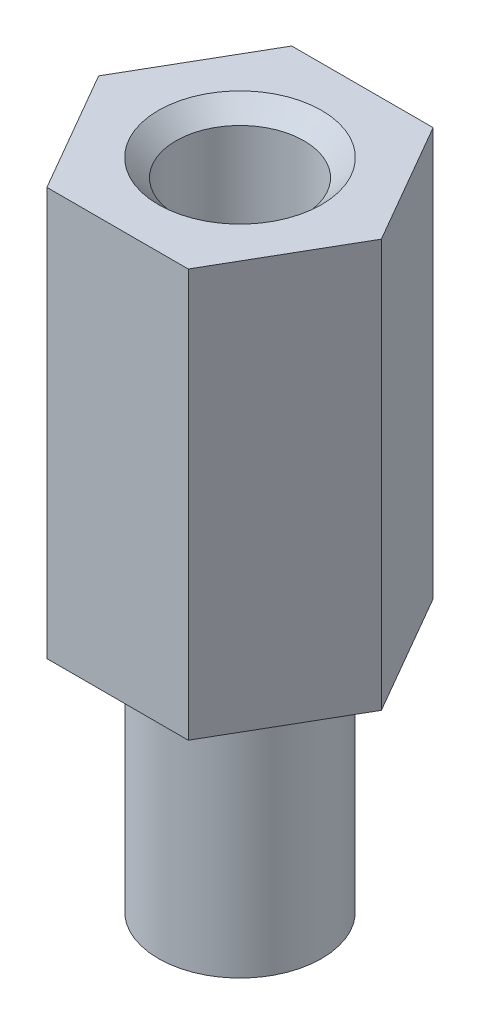
ISO-10303-21;
HEADER;
FILE_DESCRIPTION(('STEP AP214'),'2;1');
FILE_NAME('part.step','',(''),(''),'','','');
FILE_SCHEMA(('AUTOMOTIVE_DESIGN { 1 0 10303 214 1 1 1 1 }'));
ENDSEC;
DATA;
#1=APPLICATION_CONTEXT('core data for automotive mechanical design processes');
#2=APPLICATION_PROTOCOL_DEFINITION('international standard','automotive_design',2000,#1);
#3=PRODUCT_CONTEXT('',#1,'mechanical');
#4=PRODUCT('Part','Part','',(#3));
#5=PRODUCT_RELATED_PRODUCT_CATEGORY('part','',(#4));
#6=PRODUCT_DEFINITION_FORMATION('','',#4);
#7=PRODUCT_DEFINITION_CONTEXT('part definition',#1,'design');
#8=PRODUCT_DEFINITION('design','',#6,#7);
#9=PRODUCT_DEFINITION_SHAPE('','',#8);
#10=(LENGTH_UNIT() NAMED_UNIT(*) SI_UNIT(.MILLI.,.METRE.));
#11=(NAMED_UNIT(*) PLANE_ANGLE_UNIT() SI_UNIT($,.RADIAN.));
#12=(NAMED_UNIT(*) SI_UNIT($,.STERADIAN.) SOLID_ANGLE_UNIT());
#13=UNCERTAINTY_MEASURE_WITH_UNIT(LENGTH_MEASURE(1.E-05),#10,'distance_accuracy_value','');
#14=(GEOMETRIC_REPRESENTATION_CONTEXT(3) GLOBAL_UNCERTAINTY_ASSIGNED_CONTEXT((#13)) GLOBAL_UNIT_ASSIGNED_CONTEXT((#10,
#11,#12)) REPRESENTATION_CONTEXT('',''));
#15=CARTESIAN_POINT('',(0.,0.,0.));
#16=DIRECTION('',(0.,0.,1.));
#17=DIRECTION('',(1.,0.,0.));
#18=AXIS2_PLACEMENT_3D('',#15,#16,#17);
#19=CARTESIAN_POINT('',(0.,0.,0.));
#20=DIRECTION('',(0.,-1.,0.));
#21=DIRECTION('',(0.,0.,-1.));
#22=AXIS2_PLACEMENT_3D('',#19,#20,#21);
#23=PLANE('',#22);
#24=CARTESIAN_POINT('',(0.,0.,0.));
#25=DIRECTION('',(0.,-1.,0.));
#26=DIRECTION('',(0.,0.,-1.));
#27=AXIS2_PLACEMENT_3D('',#24,#25,#26);
#28=CIRCLE('',#27,0.785);
#29=CARTESIAN_POINT('',(0.,0.,-0.785));
#30=VERTEX_POINT('',#29);
#31=EDGE_CURVE('E20',#30,#30,#28,.F.);
#32=ORIENTED_EDGE('',*,*,#31,.T.);
#33=EDGE_LOOP('',(#32));
#34=FACE_BOUND('',#33,.T.);
#35=ADVANCED_FACE('F17',(#34),#23,.F.);
#36=CARTESIAN_POINT('',(0.,4.,0.));
#37=DIRECTION('',(0.,-1.,0.));
#38=DIRECTION('',(0.,0.,-1.));
#39=AXIS2_PLACEMENT_3D('',#36,#37,#38);
#40=CYLINDRICAL_SURFACE('',#39,0.785);
#41=CARTESIAN_POINT('',(0.,3.78499999993664,0.));
#42=DIRECTION('',(0.,1.,0.));
#43=DIRECTION('',(0.,0.,1.));
#44=AXIS2_PLACEMENT_3D('',#41,#42,#43);
#45=CIRCLE('',#44,0.785000000007585);
#46=CARTESIAN_POINT('',(0.,3.78499999993664,0.785000000007585));
#47=VERTEX_POINT('',#46);
#48=EDGE_CURVE('E77',#47,#47,#45,.T.);
#49=ORIENTED_EDGE('',*,*,#48,.T.);
#50=EDGE_LOOP('',(#49));
#51=FACE_BOUND('',#50,.T.);
#52=ORIENTED_EDGE('',*,*,#31,.F.);
#53=EDGE_LOOP('',(#52));
#54=FACE_BOUND('',#53,.T.);
#55=ADVANCED_FACE('F243',(#51,#54),#40,.F.);
#56=CARTESIAN_POINT('',(-0.866025403784439,4.,1.5));
#57=DIRECTION('',(0.,0.,-1.));
#58=DIRECTION('',(-1.,0.,0.));
#59=AXIS2_PLACEMENT_3D('',#56,#57,#58);
#60=PLANE('',#59);
#61=DIRECTION('',(-1.,0.,0.));
#62=VECTOR('',#61,1.);
#63=CARTESIAN_POINT('',(-0.866025403784439,-1.,1.5));
#64=LINE('',#63,#62);
#65=CARTESIAN_POINT('',(0.866025403784439,-1.,1.5));
#66=VERTEX_POINT('',#65);
#67=CARTESIAN_POINT('',(-0.866025403784439,-1.,1.5));
#68=VERTEX_POINT('',#67);
#69=EDGE_CURVE('E68',#66,#68,#64,.T.);
#70=ORIENTED_EDGE('',*,*,#69,.F.);
#71=DIRECTION('',(0.,1.,0.));
#72=VECTOR('',#71,1.);
#73=CARTESIAN_POINT('',(0.866025403784439,4.,1.5));
#74=LINE('',#73,#72);
#75=CARTESIAN_POINT('',(0.866025403784439,4.,1.5));
#76=VERTEX_POINT('',#75);
#77=EDGE_CURVE('E90',#66,#76,#74,.T.);
#78=ORIENTED_EDGE('',*,*,#77,.T.);
#79=DIRECTION('',(-1.,0.,0.));
#80=VECTOR('',#79,1.);
#81=CARTESIAN_POINT('',(-0.866025403784439,4.,1.5));
#82=LINE('',#81,#80);
#83=CARTESIAN_POINT('',(-0.866025403784439,4.,1.5));
#84=VERTEX_POINT('',#83);
#85=EDGE_CURVE('E78',#84,#76,#82,.F.);
#86=ORIENTED_EDGE('',*,*,#85,.F.);
#87=DIRECTION('',(0.,1.,0.));
#88=VECTOR('',#87,1.);
#89=CARTESIAN_POINT('',(-0.866025403784439,4.,1.5));
#90=LINE('',#89,#88);
#91=EDGE_CURVE('E81',#84,#68,#90,.F.);
#92=ORIENTED_EDGE('',*,*,#91,.T.);
#93=EDGE_LOOP('',(#70,#78,#86,#92));
#94=FACE_BOUND('',#93,.T.);
#95=ADVANCED_FACE('F82',(#94),#60,.F.);
#96=CARTESIAN_POINT('',(0.,3.99999999984857,0.));
#97=DIRECTION('',(0.,1.,0.));
#98=DIRECTION('',(0.,0.,1.));
#99=AXIS2_PLACEMENT_3D('',#96,#97,#98);
#100=CONICAL_SURFACE('',#99,0.99999999991951,0.785398163397448);
#101=ORIENTED_EDGE('',*,*,#48,.F.);
#102=EDGE_LOOP('',(#101));
#103=FACE_BOUND('',#102,.T.);
#104=CARTESIAN_POINT('',(0.,3.99999999990541,0.));
#105=DIRECTION('',(0.,1.,0.));
#106=DIRECTION('',(0.,0.,1.));
#107=AXIS2_PLACEMENT_3D('',#104,#105,#106);
#108=CIRCLE('',#107,0.999999999976353);
#109=CARTESIAN_POINT('',(0.,3.99999999990541,0.999999999976353));
#110=VERTEX_POINT('',#109);
#111=EDGE_CURVE('E99',#110,#110,#108,.F.);
#112=ORIENTED_EDGE('',*,*,#111,.F.);
#113=EDGE_LOOP('',(#112));
#114=FACE_BOUND('',#113,.T.);
#115=ADVANCED_FACE('F227',(#103,#114),#100,.F.);
#116=CARTESIAN_POINT('',(-1.73205080756888,4.,0.));
#117=DIRECTION('',(0.866025403784439,0.,-0.5));
#118=DIRECTION('',(-0.5,0.,-0.866025403784439));
#119=AXIS2_PLACEMENT_3D('',#116,#117,#118);
#120=PLANE('',#119);
#121=DIRECTION('',(-0.5,0.,-0.866025403784439));
#122=VECTOR('',#121,1.);
#123=CARTESIAN_POINT('',(-1.73205080756888,-1.,0.));
#124=LINE('',#123,#122);
#125=CARTESIAN_POINT('',(-1.73205080756888,-1.,0.));
#126=VERTEX_POINT('',#125);
#127=EDGE_CURVE('E72',#68,#126,#124,.T.);
#128=ORIENTED_EDGE('',*,*,#127,.F.);
#129=ORIENTED_EDGE('',*,*,#91,.F.);
#130=DIRECTION('',(0.5,0.,0.866025403784439));
#131=VECTOR('',#130,1.);
#132=CARTESIAN_POINT('',(-1.73205080756888,4.,0.));
#133=LINE('',#132,#131);
#134=CARTESIAN_POINT('',(-1.73205080756888,4.,0.));
#135=VERTEX_POINT('',#134);
#136=EDGE_CURVE('E104',#135,#84,#133,.T.);
#137=ORIENTED_EDGE('',*,*,#136,.F.);
#138=DIRECTION('',(0.,1.,0.));
#139=VECTOR('',#138,1.);
#140=CARTESIAN_POINT('',(-1.73205080756888,4.,0.));
#141=LINE('',#140,#139);
#142=EDGE_CURVE('E88',#135,#126,#141,.F.);
#143=ORIENTED_EDGE('',*,*,#142,.T.);
#144=EDGE_LOOP('',(#128,#129,#137,#143));
#145=FACE_BOUND('',#144,.T.);
#146=ADVANCED_FACE('F86',(#145),#120,.F.);
#147=CARTESIAN_POINT('',(0.866025403784439,4.,1.5));
#148=DIRECTION('',(-0.866025403784432,0.,-0.500000000000011));
#149=DIRECTION('',(-0.500000000000011,0.,0.866025403784432));
#150=AXIS2_PLACEMENT_3D('',#147,#148,#149);
#151=PLANE('',#150);
#152=DIRECTION('',(-0.500000000000011,0.,0.866025403784432));
#153=VECTOR('',#152,1.);
#154=CARTESIAN_POINT('',(0.866025403784439,-1.,1.5));
#155=LINE('',#154,#153);
#156=CARTESIAN_POINT('',(1.7320508075689,-1.,0.));
#157=VERTEX_POINT('',#156);
#158=EDGE_CURVE('E66',#157,#66,#155,.T.);
#159=ORIENTED_EDGE('',*,*,#158,.F.);
#160=DIRECTION('',(0.,1.,0.));
#161=VECTOR('',#160,1.);
#162=CARTESIAN_POINT('',(1.7320508075689,4.,0.));
#163=LINE('',#162,#161);
#164=CARTESIAN_POINT('',(1.7320508075689,4.,0.));
#165=VERTEX_POINT('',#164);
#166=EDGE_CURVE('E118',#157,#165,#163,.T.);
#167=ORIENTED_EDGE('',*,*,#166,.T.);
#168=DIRECTION('',(0.500000000000011,0.,-0.866025403784432));
#169=VECTOR('',#168,1.);
#170=CARTESIAN_POINT('',(0.866025403784439,4.,1.5));
#171=LINE('',#170,#169);
#172=EDGE_CURVE('E101',#76,#165,#171,.T.);
#173=ORIENTED_EDGE('',*,*,#172,.F.);
#174=ORIENTED_EDGE('',*,*,#77,.F.);
#175=EDGE_LOOP('',(#159,#167,#173,#174));
#176=FACE_BOUND('',#175,.T.);
#177=ADVANCED_FACE('F139',(#176),#151,.F.);
#178=CARTESIAN_POINT('',(0.,4.,0.));
#179=DIRECTION('',(0.,1.,0.));
#180=DIRECTION('',(0.,0.,1.));
#181=AXIS2_PLACEMENT_3D('',#178,#179,#180);
#182=PLANE('',#181);
#183=ORIENTED_EDGE('',*,*,#136,.T.);
#184=ORIENTED_EDGE('',*,*,#85,.T.);
#185=ORIENTED_EDGE('',*,*,#172,.T.);
#186=DIRECTION('',(0.500000000000008,0.,0.866025403784434));
#187=VECTOR('',#186,1.);
#188=CARTESIAN_POINT('',(1.7320508075689,4.,0.));
#189=LINE('',#188,#187);
#190=CARTESIAN_POINT('',(0.866025403784438,4.,-1.5));
#191=VERTEX_POINT('',#190);
#192=EDGE_CURVE('E114',#165,#191,#189,.F.);
#193=ORIENTED_EDGE('',*,*,#192,.T.);
#194=DIRECTION('',(1.,0.,0.));
#195=VECTOR('',#194,1.);
#196=CARTESIAN_POINT('',(0.866025403784438,4.,-1.5));
#197=LINE('',#196,#195);
#198=CARTESIAN_POINT('',(-0.866025403784438,4.,-1.5));
#199=VERTEX_POINT('',#198);
#200=EDGE_CURVE('E121',#191,#199,#197,.F.);
#201=ORIENTED_EDGE('',*,*,#200,.T.);
#202=DIRECTION('',(0.5,0.,-0.866025403784439));
#203=VECTOR('',#202,1.);
#204=CARTESIAN_POINT('',(-0.866025403784439,4.,-1.5));
#205=LINE('',#204,#203);
#206=EDGE_CURVE('E109',#199,#135,#205,.F.);
#207=ORIENTED_EDGE('',*,*,#206,.T.);
#208=EDGE_LOOP('',(#183,#184,#185,#193,#201,#207));
#209=FACE_BOUND('',#208,.T.);
#210=ORIENTED_EDGE('',*,*,#111,.T.);
#211=EDGE_LOOP('',(#210));
#212=FACE_BOUND('',#211,.T.);
#213=ADVANCED_FACE('F141',(#209,#212),#182,.T.);
#214=CARTESIAN_POINT('',(-0.866025403784439,4.,-1.5));
#215=DIRECTION('',(0.866025403784439,0.,0.5));
#216=DIRECTION('',(0.5,0.,-0.866025403784439));
#217=AXIS2_PLACEMENT_3D('',#214,#215,#216);
#218=PLANE('',#217);
#219=DIRECTION('',(0.5,0.,-0.866025403784439));
#220=VECTOR('',#219,1.);
#221=CARTESIAN_POINT('',(-0.866025403784439,-1.,-1.5));
#222=LINE('',#221,#220);
#223=CARTESIAN_POINT('',(-0.866025403784439,-1.,-1.5));
#224=VERTEX_POINT('',#223);
#225=EDGE_CURVE('E35',#126,#224,#222,.T.);
#226=ORIENTED_EDGE('',*,*,#225,.F.);
#227=ORIENTED_EDGE('',*,*,#142,.F.);
#228=ORIENTED_EDGE('',*,*,#206,.F.);
#229=DIRECTION('',(0.,1.,0.));
#230=VECTOR('',#229,1.);
#231=CARTESIAN_POINT('',(-0.866025403784439,4.,-1.5));
#232=LINE('',#231,#230);
#233=EDGE_CURVE('E123',#199,#224,#232,.F.);
#234=ORIENTED_EDGE('',*,*,#233,.T.);
#235=EDGE_LOOP('',(#226,#227,#228,#234));
#236=FACE_BOUND('',#235,.T.);
#237=ADVANCED_FACE('F144',(#236),#218,.F.);
#238=CARTESIAN_POINT('',(1.7320508075689,4.,0.));
#239=DIRECTION('',(-0.866025403784434,0.,0.500000000000008));
#240=DIRECTION('',(0.500000000000008,0.,0.866025403784434));
#241=AXIS2_PLACEMENT_3D('',#238,#239,#240);
#242=PLANE('',#241);
#243=DIRECTION('',(0.500000000000008,0.,0.866025403784434));
#244=VECTOR('',#243,1.);
#245=CARTESIAN_POINT('',(1.7320508075689,-1.,0.));
#246=LINE('',#245,#244);
#247=CARTESIAN_POINT('',(0.866025403784438,-1.,-1.5));
#248=VERTEX_POINT('',#247);
#249=EDGE_CURVE('E116',#248,#157,#246,.T.);
#250=ORIENTED_EDGE('',*,*,#249,.F.);
#251=DIRECTION('',(0.,1.,0.));
#252=VECTOR('',#251,1.);
#253=CARTESIAN_POINT('',(0.866025403784438,4.,-1.5));
#254=LINE('',#253,#252);
#255=EDGE_CURVE('E125',#248,#191,#254,.T.);
#256=ORIENTED_EDGE('',*,*,#255,.T.);
#257=ORIENTED_EDGE('',*,*,#192,.F.);
#258=ORIENTED_EDGE('',*,*,#166,.F.);
#259=EDGE_LOOP('',(#250,#256,#257,#258));
#260=FACE_BOUND('',#259,.T.);
#261=ADVANCED_FACE('F136',(#260),#242,.F.);
#262=CARTESIAN_POINT('',(0.866025403784438,4.,-1.5));
#263=DIRECTION('',(0.,0.,1.));
#264=DIRECTION('',(1.,0.,0.));
#265=AXIS2_PLACEMENT_3D('',#262,#263,#264);
#266=PLANE('',#265);
#267=DIRECTION('',(1.,0.,0.));
#268=VECTOR('',#267,1.);
#269=CARTESIAN_POINT('',(0.,-1.,-1.5));
#270=LINE('',#269,#268);
#271=EDGE_CURVE('E98',#224,#248,#270,.T.);
#272=ORIENTED_EDGE('',*,*,#271,.F.);
#273=ORIENTED_EDGE('',*,*,#233,.F.);
#274=ORIENTED_EDGE('',*,*,#200,.F.);
#275=ORIENTED_EDGE('',*,*,#255,.F.);
#276=EDGE_LOOP('',(#272,#273,#274,#275));
#277=FACE_BOUND('',#276,.T.);
#278=ADVANCED_FACE('F132',(#277),#266,.F.);
#279=CARTESIAN_POINT('',(0.,-4.,0.));
#280=DIRECTION('',(0.,-1.,0.));
#281=DIRECTION('',(0.,0.,-1.));
#282=AXIS2_PLACEMENT_3D('',#279,#280,#281);
#283=PLANE('',#282);
#284=CARTESIAN_POINT('',(0.,-4.,0.));
#285=DIRECTION('',(0.,1.,0.));
#286=DIRECTION('',(0.,0.,1.));
#287=AXIS2_PLACEMENT_3D('',#284,#285,#286);
#288=CIRCLE('',#287,1.);
#289=CARTESIAN_POINT('',(0.,-4.,1.));
#290=VERTEX_POINT('',#289);
#291=EDGE_CURVE('E26',#290,#290,#288,.T.);
#292=ORIENTED_EDGE('',*,*,#291,.F.);
#293=EDGE_LOOP('',(#292));
#294=FACE_BOUND('',#293,.T.);
#295=ADVANCED_FACE('F161',(#294),#283,.T.);
#296=CARTESIAN_POINT('',(0.,-1.,0.));
#297=DIRECTION('',(0.,-1.,0.));
#298=DIRECTION('',(0.,0.,-1.));
#299=AXIS2_PLACEMENT_3D('',#296,#297,#298);
#300=PLANE('',#299);
#301=CARTESIAN_POINT('',(0.,-1.,0.));
#302=DIRECTION('',(0.,1.,0.));
#303=DIRECTION('',(0.,0.,1.));
#304=AXIS2_PLACEMENT_3D('',#301,#302,#303);
#305=CIRCLE('',#304,1.);
#306=CARTESIAN_POINT('',(0.,-1.,1.));
#307=VERTEX_POINT('',#306);
#308=EDGE_CURVE('E11',#307,#307,#305,.F.);
#309=ORIENTED_EDGE('',*,*,#308,.F.);
#310=EDGE_LOOP('',(#309));
#311=FACE_BOUND('',#310,.T.);
#312=ORIENTED_EDGE('',*,*,#225,.T.);
#313=ORIENTED_EDGE('',*,*,#271,.T.);
#314=ORIENTED_EDGE('',*,*,#249,.T.);
#315=ORIENTED_EDGE('',*,*,#158,.T.);
#316=ORIENTED_EDGE('',*,*,#69,.T.);
#317=ORIENTED_EDGE('',*,*,#127,.T.);
#318=EDGE_LOOP('',(#312,#313,#314,#315,#316,#317));
#319=FACE_BOUND('',#318,.T.);
#320=ADVANCED_FACE('F70',(#311,#319),#300,.T.);
#321=CARTESIAN_POINT('',(0.,-4.,0.));
#322=DIRECTION('',(0.,1.,0.));
#323=DIRECTION('',(0.,0.,1.));
#324=AXIS2_PLACEMENT_3D('',#321,#322,#323);
#325=CYLINDRICAL_SURFACE('',#324,1.);
#326=ORIENTED_EDGE('',*,*,#308,.T.);
#327=EDGE_LOOP('',(#326));
#328=FACE_BOUND('',#327,.T.);
#329=ORIENTED_EDGE('',*,*,#291,.T.);
#330=EDGE_LOOP('',(#329));
#331=FACE_BOUND('',#330,.T.);
#332=ADVANCED_FACE('F154',(#328,#331),#325,.T.);
#333=CLOSED_SHELL('',(#35,#55,#95,#115,#146,#177,#213,#237,#261,#278,#295,#320,#332));
#334=MANIFOLD_SOLID_BREP('B1',#333);
#335=ADVANCED_BREP_SHAPE_REPRESENTATION('',(#18,#334),#14);
#336=SHAPE_DEFINITION_REPRESENTATION(#9,#335);
ENDSEC;
END-ISO-10303-21;
